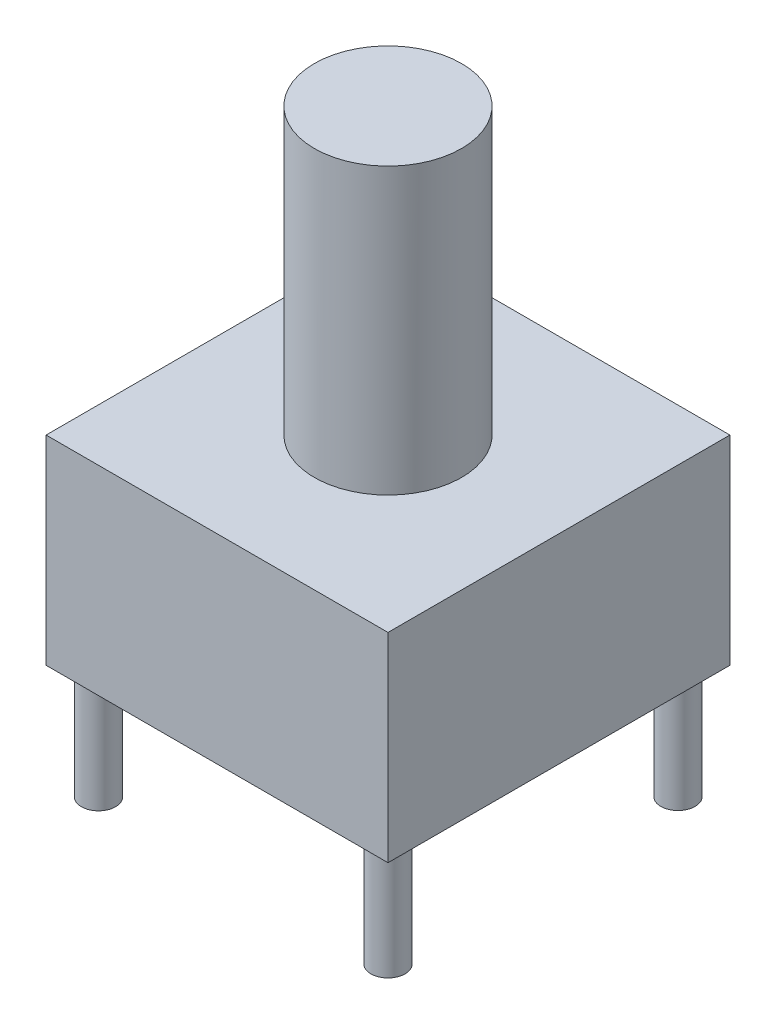
ISO-10303-21;
HEADER;
FILE_DESCRIPTION(('STEP AP214'),'2;1');
FILE_NAME('part.step','',(''),(''),'','','');
FILE_SCHEMA(('AUTOMOTIVE_DESIGN { 1 0 10303 214 1 1 1 1 }'));
ENDSEC;
DATA;
#1=APPLICATION_CONTEXT('core data for automotive mechanical design processes');
#2=APPLICATION_PROTOCOL_DEFINITION('international standard','automotive_design',2000,#1);
#3=PRODUCT_CONTEXT('',#1,'mechanical');
#4=PRODUCT('Part','Part','',(#3));
#5=PRODUCT_RELATED_PRODUCT_CATEGORY('part','',(#4));
#6=PRODUCT_DEFINITION_FORMATION('','',#4);
#7=PRODUCT_DEFINITION_CONTEXT('part definition',#1,'design');
#8=PRODUCT_DEFINITION('design','',#6,#7);
#9=PRODUCT_DEFINITION_SHAPE('','',#8);
#10=(LENGTH_UNIT() NAMED_UNIT(*) SI_UNIT(.MILLI.,.METRE.));
#11=(NAMED_UNIT(*) PLANE_ANGLE_UNIT() SI_UNIT($,.RADIAN.));
#12=(NAMED_UNIT(*) SI_UNIT($,.STERADIAN.) SOLID_ANGLE_UNIT());
#13=UNCERTAINTY_MEASURE_WITH_UNIT(LENGTH_MEASURE(1.E-05),#10,'distance_accuracy_value','');
#14=(GEOMETRIC_REPRESENTATION_CONTEXT(3) GLOBAL_UNCERTAINTY_ASSIGNED_CONTEXT((#13)) GLOBAL_UNIT_ASSIGNED_CONTEXT((#10,
#11,#12)) REPRESENTATION_CONTEXT('',''));
#15=CARTESIAN_POINT('',(0.,0.,0.));
#16=DIRECTION('',(0.,0.,1.));
#17=DIRECTION('',(1.,0.,0.));
#18=AXIS2_PLACEMENT_3D('',#15,#16,#17);
#19=CARTESIAN_POINT('',(0.,3.5,0.));
#20=DIRECTION('',(1.,0.,0.));
#21=DIRECTION('',(0.,0.,-1.));
#22=AXIS2_PLACEMENT_3D('',#19,#20,#21);
#23=PLANE('',#22);
#24=DIRECTION('',(0.,0.,1.));
#25=VECTOR('',#24,1.);
#26=CARTESIAN_POINT('',(0.,0.,0.));
#27=LINE('',#26,#25);
#28=CARTESIAN_POINT('',(0.,0.,-6.));
#29=VERTEX_POINT('',#28);
#30=CARTESIAN_POINT('',(0.,0.,0.));
#31=VERTEX_POINT('',#30);
#32=EDGE_CURVE('E101',#29,#31,#27,.T.);
#33=ORIENTED_EDGE('',*,*,#32,.T.);
#34=DIRECTION('',(0.,-1.,0.));
#35=VECTOR('',#34,1.);
#36=CARTESIAN_POINT('',(0.,3.5,0.));
#37=LINE('',#36,#35);
#38=CARTESIAN_POINT('',(0.,3.5,0.));
#39=VERTEX_POINT('',#38);
#40=EDGE_CURVE('E43',#39,#31,#37,.T.);
#41=ORIENTED_EDGE('',*,*,#40,.F.);
#42=DIRECTION('',(0.,0.,1.));
#43=VECTOR('',#42,1.);
#44=CARTESIAN_POINT('',(0.,3.5,0.));
#45=LINE('',#44,#43);
#46=CARTESIAN_POINT('',(0.,3.5,-6.));
#47=VERTEX_POINT('',#46);
#48=EDGE_CURVE('E87',#47,#39,#45,.T.);
#49=ORIENTED_EDGE('',*,*,#48,.F.);
#50=DIRECTION('',(0.,-1.,0.));
#51=VECTOR('',#50,1.);
#52=CARTESIAN_POINT('',(0.,3.5,-6.));
#53=LINE('',#52,#51);
#54=EDGE_CURVE('E97',#47,#29,#53,.T.);
#55=ORIENTED_EDGE('',*,*,#54,.T.);
#56=EDGE_LOOP('',(#33,#41,#49,#55));
#57=FACE_BOUND('',#56,.T.);
#58=ADVANCED_FACE('F35',(#57),#23,.F.);
#59=CARTESIAN_POINT('',(0.,3.5,0.));
#60=DIRECTION('',(0.,0.,-1.));
#61=DIRECTION('',(-1.,0.,0.));
#62=AXIS2_PLACEMENT_3D('',#59,#60,#61);
#63=PLANE('',#62);
#64=DIRECTION('',(1.,0.,0.));
#65=VECTOR('',#64,1.);
#66=CARTESIAN_POINT('',(0.,0.,0.));
#67=LINE('',#66,#65);
#68=CARTESIAN_POINT('',(6.,0.,0.));
#69=VERTEX_POINT('',#68);
#70=EDGE_CURVE('E92',#31,#69,#67,.T.);
#71=ORIENTED_EDGE('',*,*,#70,.T.);
#72=DIRECTION('',(0.,-1.,0.));
#73=VECTOR('',#72,1.);
#74=CARTESIAN_POINT('',(6.,3.5,0.));
#75=LINE('',#74,#73);
#76=CARTESIAN_POINT('',(6.,3.5,0.));
#77=VERTEX_POINT('',#76);
#78=EDGE_CURVE('E90',#77,#69,#75,.T.);
#79=ORIENTED_EDGE('',*,*,#78,.F.);
#80=DIRECTION('',(1.,0.,0.));
#81=VECTOR('',#80,1.);
#82=CARTESIAN_POINT('',(0.,3.5,0.));
#83=LINE('',#82,#81);
#84=EDGE_CURVE('E82',#39,#77,#83,.T.);
#85=ORIENTED_EDGE('',*,*,#84,.F.);
#86=ORIENTED_EDGE('',*,*,#40,.T.);
#87=EDGE_LOOP('',(#71,#79,#85,#86));
#88=FACE_BOUND('',#87,.T.);
#89=ADVANCED_FACE('F91',(#88),#63,.F.);
#90=CARTESIAN_POINT('',(6.,3.5,0.));
#91=DIRECTION('',(-1.,0.,0.));
#92=DIRECTION('',(0.,0.,1.));
#93=AXIS2_PLACEMENT_3D('',#90,#91,#92);
#94=PLANE('',#93);
#95=DIRECTION('',(0.,0.,-1.));
#96=VECTOR('',#95,1.);
#97=CARTESIAN_POINT('',(6.,0.,0.));
#98=LINE('',#97,#96);
#99=CARTESIAN_POINT('',(6.,0.,-6.));
#100=VERTEX_POINT('',#99);
#101=EDGE_CURVE('E68',#69,#100,#98,.T.);
#102=ORIENTED_EDGE('',*,*,#101,.T.);
#103=DIRECTION('',(0.,-1.,0.));
#104=VECTOR('',#103,1.);
#105=CARTESIAN_POINT('',(6.,3.5,-6.));
#106=LINE('',#105,#104);
#107=CARTESIAN_POINT('',(6.,3.5,-6.));
#108=VERTEX_POINT('',#107);
#109=EDGE_CURVE('E93',#108,#100,#106,.T.);
#110=ORIENTED_EDGE('',*,*,#109,.F.);
#111=DIRECTION('',(0.,0.,-1.));
#112=VECTOR('',#111,1.);
#113=CARTESIAN_POINT('',(6.,3.5,0.));
#114=LINE('',#113,#112);
#115=EDGE_CURVE('E85',#77,#108,#114,.T.);
#116=ORIENTED_EDGE('',*,*,#115,.F.);
#117=ORIENTED_EDGE('',*,*,#78,.T.);
#118=EDGE_LOOP('',(#102,#110,#116,#117));
#119=FACE_BOUND('',#118,.T.);
#120=ADVANCED_FACE('F95',(#119),#94,.F.);
#121=CARTESIAN_POINT('',(0.,3.5,-6.));
#122=DIRECTION('',(0.,0.,1.));
#123=DIRECTION('',(1.,0.,0.));
#124=AXIS2_PLACEMENT_3D('',#121,#122,#123);
#125=PLANE('',#124);
#126=DIRECTION('',(-1.,0.,0.));
#127=VECTOR('',#126,1.);
#128=CARTESIAN_POINT('',(0.,0.,-6.));
#129=LINE('',#128,#127);
#130=EDGE_CURVE('E74',#100,#29,#129,.T.);
#131=ORIENTED_EDGE('',*,*,#130,.T.);
#132=ORIENTED_EDGE('',*,*,#54,.F.);
#133=DIRECTION('',(-1.,0.,0.));
#134=VECTOR('',#133,1.);
#135=CARTESIAN_POINT('',(0.,3.5,-6.));
#136=LINE('',#135,#134);
#137=EDGE_CURVE('E51',#108,#47,#136,.T.);
#138=ORIENTED_EDGE('',*,*,#137,.F.);
#139=ORIENTED_EDGE('',*,*,#109,.T.);
#140=EDGE_LOOP('',(#131,#132,#138,#139));
#141=FACE_BOUND('',#140,.T.);
#142=ADVANCED_FACE('F126',(#141),#125,.F.);
#143=CARTESIAN_POINT('',(0.,3.5,0.));
#144=DIRECTION('',(0.,-1.,0.));
#145=DIRECTION('',(0.,0.,-1.));
#146=AXIS2_PLACEMENT_3D('',#143,#144,#145);
#147=PLANE('',#146);
#148=CARTESIAN_POINT('',(2.99929100026475,3.5,-3.));
#149=DIRECTION('',(0.,-1.,0.));
#150=DIRECTION('',(0.,0.,-1.));
#151=AXIS2_PLACEMENT_3D('',#148,#149,#150);
#152=CIRCLE('',#151,1.29211517942145);
#153=CARTESIAN_POINT('',(2.99929100026475,3.5,-4.29211517942145));
#154=VERTEX_POINT('',#153);
#155=EDGE_CURVE('E11',#154,#154,#152,.F.);
#156=ORIENTED_EDGE('',*,*,#155,.F.);
#157=EDGE_LOOP('',(#156));
#158=FACE_BOUND('',#157,.T.);
#159=ORIENTED_EDGE('',*,*,#48,.T.);
#160=ORIENTED_EDGE('',*,*,#84,.T.);
#161=ORIENTED_EDGE('',*,*,#115,.T.);
#162=ORIENTED_EDGE('',*,*,#137,.T.);
#163=EDGE_LOOP('',(#159,#160,#161,#162));
#164=FACE_BOUND('',#163,.T.);
#165=ADVANCED_FACE('F83',(#158,#164),#147,.F.);
#166=CARTESIAN_POINT('',(0.,0.,0.));
#167=DIRECTION('',(0.,-1.,0.));
#168=DIRECTION('',(0.,0.,-1.));
#169=AXIS2_PLACEMENT_3D('',#166,#167,#168);
#170=PLANE('',#169);
#171=CARTESIAN_POINT('',(5.54,0.,-5.54888125660113));
#172=DIRECTION('',(0.,-1.,0.));
#173=DIRECTION('',(0.,0.,-1.));
#174=AXIS2_PLACEMENT_3D('',#171,#172,#173);
#175=CIRCLE('',#174,0.3);
#176=CARTESIAN_POINT('',(5.54,0.,-5.84888125660113));
#177=VERTEX_POINT('',#176);
#178=EDGE_CURVE('E252',#177,#177,#175,.T.);
#179=ORIENTED_EDGE('',*,*,#178,.F.);
#180=EDGE_LOOP('',(#179));
#181=FACE_BOUND('',#180,.T.);
#182=CARTESIAN_POINT('',(0.46,0.,-5.54));
#183=DIRECTION('',(0.,-1.,0.));
#184=DIRECTION('',(0.,0.,-1.));
#185=AXIS2_PLACEMENT_3D('',#182,#183,#184);
#186=CIRCLE('',#185,0.3);
#187=CARTESIAN_POINT('',(0.46,0.,-5.84));
#188=VERTEX_POINT('',#187);
#189=EDGE_CURVE('E251',#188,#188,#186,.T.);
#190=ORIENTED_EDGE('',*,*,#189,.F.);
#191=EDGE_LOOP('',(#190));
#192=FACE_BOUND('',#191,.T.);
#193=CARTESIAN_POINT('',(5.54,0.,-0.46));
#194=DIRECTION('',(0.,-1.,0.));
#195=DIRECTION('',(0.,0.,-1.));
#196=AXIS2_PLACEMENT_3D('',#193,#194,#195);
#197=CIRCLE('',#196,0.3);
#198=CARTESIAN_POINT('',(5.54,0.,-0.76));
#199=VERTEX_POINT('',#198);
#200=EDGE_CURVE('E261',#199,#199,#197,.T.);
#201=ORIENTED_EDGE('',*,*,#200,.F.);
#202=EDGE_LOOP('',(#201));
#203=FACE_BOUND('',#202,.T.);
#204=CARTESIAN_POINT('',(0.46,0.,-0.46));
#205=DIRECTION('',(0.,-1.,0.));
#206=DIRECTION('',(0.,0.,-1.));
#207=AXIS2_PLACEMENT_3D('',#204,#205,#206);
#208=CIRCLE('',#207,0.3);
#209=CARTESIAN_POINT('',(0.46,0.,-0.76));
#210=VERTEX_POINT('',#209);
#211=EDGE_CURVE('E266',#210,#210,#208,.T.);
#212=ORIENTED_EDGE('',*,*,#211,.F.);
#213=EDGE_LOOP('',(#212));
#214=FACE_BOUND('',#213,.T.);
#215=ORIENTED_EDGE('',*,*,#32,.F.);
#216=ORIENTED_EDGE('',*,*,#130,.F.);
#217=ORIENTED_EDGE('',*,*,#101,.F.);
#218=ORIENTED_EDGE('',*,*,#70,.F.);
#219=EDGE_LOOP('',(#215,#216,#217,#218));
#220=FACE_BOUND('',#219,.T.);
#221=ADVANCED_FACE('F112',(#181,#192,#203,#214,#220),#170,.T.);
#222=CARTESIAN_POINT('',(2.99929100026475,8.5,-3.));
#223=DIRECTION('',(0.,-1.,0.));
#224=DIRECTION('',(0.,0.,-1.));
#225=AXIS2_PLACEMENT_3D('',#222,#223,#224);
#226=CYLINDRICAL_SURFACE('',#225,1.29211517942145);
#227=CARTESIAN_POINT('',(2.99929100026475,8.5,-3.));
#228=DIRECTION('',(0.,1.,0.));
#229=DIRECTION('',(0.,0.,1.));
#230=AXIS2_PLACEMENT_3D('',#227,#228,#229);
#231=CIRCLE('',#230,1.29211517942145);
#232=CARTESIAN_POINT('',(2.99929100026475,8.5,-1.70788482057855));
#233=VERTEX_POINT('',#232);
#234=EDGE_CURVE('E104',#233,#233,#231,.T.);
#235=ORIENTED_EDGE('',*,*,#234,.F.);
#236=EDGE_LOOP('',(#235));
#237=FACE_BOUND('',#236,.T.);
#238=ORIENTED_EDGE('',*,*,#155,.T.);
#239=EDGE_LOOP('',(#238));
#240=FACE_BOUND('',#239,.T.);
#241=ADVANCED_FACE('F114',(#237,#240),#226,.T.);
#242=CARTESIAN_POINT('',(2.99929100026475,8.5,-3.));
#243=DIRECTION('',(0.,1.,0.));
#244=DIRECTION('',(0.,0.,1.));
#245=AXIS2_PLACEMENT_3D('',#242,#243,#244);
#246=PLANE('',#245);
#247=ORIENTED_EDGE('',*,*,#234,.T.);
#248=EDGE_LOOP('',(#247));
#249=FACE_BOUND('',#248,.T.);
#250=ADVANCED_FACE('F122',(#249),#246,.T.);
#251=CARTESIAN_POINT('',(0.46,-2.,-0.46));
#252=DIRECTION('',(0.,1.,0.));
#253=DIRECTION('',(0.,0.,1.));
#254=AXIS2_PLACEMENT_3D('',#251,#252,#253);
#255=CYLINDRICAL_SURFACE('',#254,0.3);
#256=CARTESIAN_POINT('',(0.46,-2.,-0.46));
#257=DIRECTION('',(0.,-1.,0.));
#258=DIRECTION('',(0.,0.,-1.));
#259=AXIS2_PLACEMENT_3D('',#256,#257,#258);
#260=CIRCLE('',#259,0.3);
#261=CARTESIAN_POINT('',(0.46,-2.,-0.76));
#262=VERTEX_POINT('',#261);
#263=EDGE_CURVE('E269',#262,#262,#260,.T.);
#264=ORIENTED_EDGE('',*,*,#263,.F.);
#265=EDGE_LOOP('',(#264));
#266=FACE_BOUND('',#265,.T.);
#267=ORIENTED_EDGE('',*,*,#211,.T.);
#268=EDGE_LOOP('',(#267));
#269=FACE_BOUND('',#268,.T.);
#270=ADVANCED_FACE('F162',(#266,#269),#255,.T.);
#271=CARTESIAN_POINT('',(0.46,-2.,-0.46));
#272=DIRECTION('',(0.,-1.,0.));
#273=DIRECTION('',(0.,0.,-1.));
#274=AXIS2_PLACEMENT_3D('',#271,#272,#273);
#275=PLANE('',#274);
#276=ORIENTED_EDGE('',*,*,#263,.T.);
#277=EDGE_LOOP('',(#276));
#278=FACE_BOUND('',#277,.T.);
#279=ADVANCED_FACE('F169',(#278),#275,.T.);
#280=CARTESIAN_POINT('',(5.54,-2.,-0.46));
#281=DIRECTION('',(0.,1.,0.));
#282=DIRECTION('',(0.,0.,1.));
#283=AXIS2_PLACEMENT_3D('',#280,#281,#282);
#284=CYLINDRICAL_SURFACE('',#283,0.3);
#285=CARTESIAN_POINT('',(5.54,-2.,-0.46));
#286=DIRECTION('',(0.,-1.,0.));
#287=DIRECTION('',(0.,0.,-1.));
#288=AXIS2_PLACEMENT_3D('',#285,#286,#287);
#289=CIRCLE('',#288,0.3);
#290=CARTESIAN_POINT('',(5.54,-2.,-0.76));
#291=VERTEX_POINT('',#290);
#292=EDGE_CURVE('E263',#291,#291,#289,.T.);
#293=ORIENTED_EDGE('',*,*,#292,.F.);
#294=EDGE_LOOP('',(#293));
#295=FACE_BOUND('',#294,.T.);
#296=ORIENTED_EDGE('',*,*,#200,.T.);
#297=EDGE_LOOP('',(#296));
#298=FACE_BOUND('',#297,.T.);
#299=ADVANCED_FACE('F177',(#295,#298),#284,.T.);
#300=CARTESIAN_POINT('',(5.54,-2.,-0.46));
#301=DIRECTION('',(0.,-1.,0.));
#302=DIRECTION('',(0.,0.,-1.));
#303=AXIS2_PLACEMENT_3D('',#300,#301,#302);
#304=PLANE('',#303);
#305=ORIENTED_EDGE('',*,*,#292,.T.);
#306=EDGE_LOOP('',(#305));
#307=FACE_BOUND('',#306,.T.);
#308=ADVANCED_FACE('F185',(#307),#304,.T.);
#309=CARTESIAN_POINT('',(0.46,-2.,-5.54));
#310=DIRECTION('',(0.,1.,0.));
#311=DIRECTION('',(0.,0.,1.));
#312=AXIS2_PLACEMENT_3D('',#309,#310,#311);
#313=CYLINDRICAL_SURFACE('',#312,0.3);
#314=CARTESIAN_POINT('',(0.46,-2.,-5.54));
#315=DIRECTION('',(0.,-1.,0.));
#316=DIRECTION('',(0.,0.,-1.));
#317=AXIS2_PLACEMENT_3D('',#314,#315,#316);
#318=CIRCLE('',#317,0.3);
#319=CARTESIAN_POINT('',(0.46,-2.,-5.84));
#320=VERTEX_POINT('',#319);
#321=EDGE_CURVE('E255',#320,#320,#318,.T.);
#322=ORIENTED_EDGE('',*,*,#321,.F.);
#323=EDGE_LOOP('',(#322));
#324=FACE_BOUND('',#323,.T.);
#325=ORIENTED_EDGE('',*,*,#189,.T.);
#326=EDGE_LOOP('',(#325));
#327=FACE_BOUND('',#326,.T.);
#328=ADVANCED_FACE('F193',(#324,#327),#313,.T.);
#329=CARTESIAN_POINT('',(0.46,-2.,-5.54));
#330=DIRECTION('',(0.,-1.,0.));
#331=DIRECTION('',(0.,0.,-1.));
#332=AXIS2_PLACEMENT_3D('',#329,#330,#331);
#333=PLANE('',#332);
#334=ORIENTED_EDGE('',*,*,#321,.T.);
#335=EDGE_LOOP('',(#334));
#336=FACE_BOUND('',#335,.T.);
#337=ADVANCED_FACE('F201',(#336),#333,.T.);
#338=CARTESIAN_POINT('',(5.54,-2.,-5.54888125660113));
#339=DIRECTION('',(0.,1.,0.));
#340=DIRECTION('',(0.,0.,1.));
#341=AXIS2_PLACEMENT_3D('',#338,#339,#340);
#342=CYLINDRICAL_SURFACE('',#341,0.3);
#343=CARTESIAN_POINT('',(5.54,-2.,-5.54888125660113));
#344=DIRECTION('',(0.,-1.,0.));
#345=DIRECTION('',(0.,0.,-1.));
#346=AXIS2_PLACEMENT_3D('',#343,#344,#345);
#347=CIRCLE('',#346,0.3);
#348=CARTESIAN_POINT('',(5.54,-2.,-5.84888125660113));
#349=VERTEX_POINT('',#348);
#350=EDGE_CURVE('E250',#349,#349,#347,.T.);
#351=ORIENTED_EDGE('',*,*,#350,.F.);
#352=EDGE_LOOP('',(#351));
#353=FACE_BOUND('',#352,.T.);
#354=ORIENTED_EDGE('',*,*,#178,.T.);
#355=EDGE_LOOP('',(#354));
#356=FACE_BOUND('',#355,.T.);
#357=ADVANCED_FACE('F209',(#353,#356),#342,.T.);
#358=CARTESIAN_POINT('',(5.54,-2.,-5.54888125660113));
#359=DIRECTION('',(0.,-1.,0.));
#360=DIRECTION('',(0.,0.,-1.));
#361=AXIS2_PLACEMENT_3D('',#358,#359,#360);
#362=PLANE('',#361);
#363=ORIENTED_EDGE('',*,*,#350,.T.);
#364=EDGE_LOOP('',(#363));
#365=FACE_BOUND('',#364,.T.);
#366=ADVANCED_FACE('F217',(#365),#362,.T.);
#367=CLOSED_SHELL('',(#58,#89,#120,#142,#165,#221,#241,#250,#270,#279,#299,#308,#328,#337,#357,#366));
#368=MANIFOLD_SOLID_BREP('B2',#367);
#369=ADVANCED_BREP_SHAPE_REPRESENTATION('',(#18,#368),#14);
#370=SHAPE_DEFINITION_REPRESENTATION(#9,#369);
ENDSEC;
END-ISO-10303-21;
